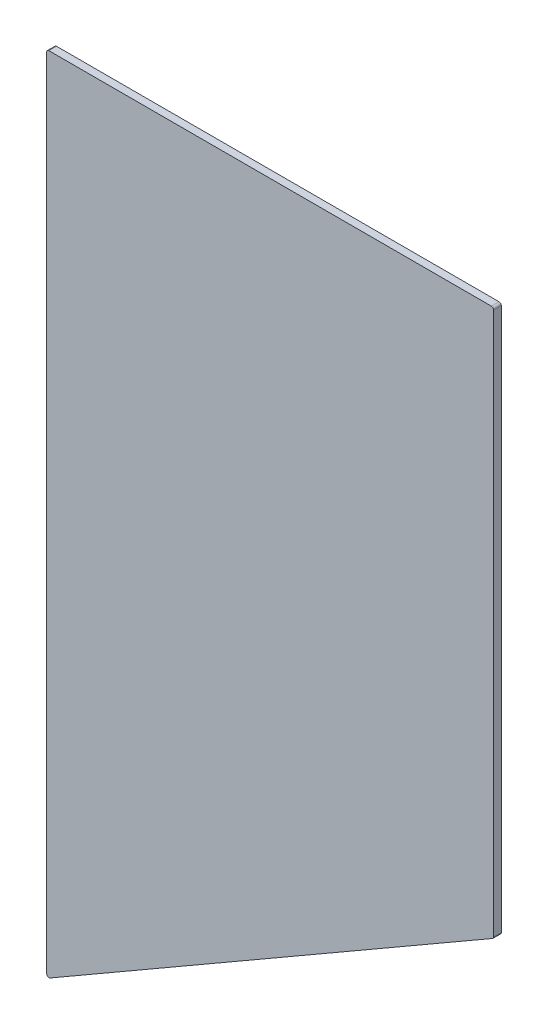
ISO-10303-21;
HEADER;
FILE_DESCRIPTION(('STEP AP214'),'2;1');
FILE_NAME('part.step','',(''),(''),'','','');
FILE_SCHEMA(('AUTOMOTIVE_DESIGN { 1 0 10303 214 1 1 1 1 }'));
ENDSEC;
DATA;
#1=APPLICATION_CONTEXT('core data for automotive mechanical design processes');
#2=APPLICATION_PROTOCOL_DEFINITION('international standard','automotive_design',2000,#1);
#3=PRODUCT_CONTEXT('',#1,'mechanical');
#4=PRODUCT('Part','Part','',(#3));
#5=PRODUCT_RELATED_PRODUCT_CATEGORY('part','',(#4));
#6=PRODUCT_DEFINITION_FORMATION('','',#4);
#7=PRODUCT_DEFINITION_CONTEXT('part definition',#1,'design');
#8=PRODUCT_DEFINITION('design','',#6,#7);
#9=PRODUCT_DEFINITION_SHAPE('','',#8);
#10=(LENGTH_UNIT() NAMED_UNIT(*) SI_UNIT(.MILLI.,.METRE.));
#11=(NAMED_UNIT(*) PLANE_ANGLE_UNIT() SI_UNIT($,.RADIAN.));
#12=(NAMED_UNIT(*) SI_UNIT($,.STERADIAN.) SOLID_ANGLE_UNIT());
#13=UNCERTAINTY_MEASURE_WITH_UNIT(LENGTH_MEASURE(1.E-05),#10,'distance_accuracy_value','');
#14=(GEOMETRIC_REPRESENTATION_CONTEXT(3) GLOBAL_UNCERTAINTY_ASSIGNED_CONTEXT((#13)) GLOBAL_UNIT_ASSIGNED_CONTEXT((#10,
#11,#12)) REPRESENTATION_CONTEXT('',''));
#15=CARTESIAN_POINT('',(0.,0.,0.));
#16=DIRECTION('',(0.,0.,1.));
#17=DIRECTION('',(1.,0.,0.));
#18=AXIS2_PLACEMENT_3D('',#15,#16,#17);
#19=CARTESIAN_POINT('',(127.,-228.6,4.3434));
#20=DIRECTION('',(-1.,0.,0.));
#21=DIRECTION('',(0.,0.,1.));
#22=AXIS2_PLACEMENT_3D('',#19,#20,#21);
#23=PLANE('',#22);
#24=DIRECTION('',(0.,1.,0.));
#25=VECTOR('',#24,1.);
#26=CARTESIAN_POINT('',(127.,-228.6,4.3434));
#27=LINE('',#26,#25);
#28=CARTESIAN_POINT('',(127.,-81.2197967839626,4.3434));
#29=VERTEX_POINT('',#28);
#30=CARTESIAN_POINT('',(127.,227.33,4.3434));
#31=VERTEX_POINT('',#30);
#32=EDGE_CURVE('E123',#29,#31,#27,.T.);
#33=ORIENTED_EDGE('',*,*,#32,.F.);
#34=DIRECTION('',(0.,0.,1.));
#35=VECTOR('',#34,1.);
#36=CARTESIAN_POINT('',(127.,-81.2197967839626,4.3434));
#37=LINE('',#36,#35);
#38=CARTESIAN_POINT('',(127.,-81.2197967839626,0.));
#39=VERTEX_POINT('',#38);
#40=EDGE_CURVE('E11',#29,#39,#37,.F.);
#41=ORIENTED_EDGE('',*,*,#40,.T.);
#42=DIRECTION('',(0.,1.,0.));
#43=VECTOR('',#42,1.);
#44=CARTESIAN_POINT('',(127.,-228.6,0.));
#45=LINE('',#44,#43);
#46=CARTESIAN_POINT('',(127.,227.33,0.));
#47=VERTEX_POINT('',#46);
#48=EDGE_CURVE('E128',#39,#47,#45,.T.);
#49=ORIENTED_EDGE('',*,*,#48,.T.);
#50=DIRECTION('',(0.,0.,-1.));
#51=VECTOR('',#50,1.);
#52=CARTESIAN_POINT('',(127.,227.33,4.3434));
#53=LINE('',#52,#51);
#54=EDGE_CURVE('E41',#47,#31,#53,.F.);
#55=ORIENTED_EDGE('',*,*,#54,.T.);
#56=EDGE_LOOP('',(#33,#41,#49,#55));
#57=FACE_BOUND('',#56,.T.);
#58=ADVANCED_FACE('F33',(#57),#23,.F.);
#59=CARTESIAN_POINT('',(-127.,228.6,4.3434));
#60=DIRECTION('',(0.,-1.,0.));
#61=DIRECTION('',(0.,0.,-1.));
#62=AXIS2_PLACEMENT_3D('',#59,#60,#61);
#63=PLANE('',#62);
#64=DIRECTION('',(-1.,0.,0.));
#65=VECTOR('',#64,1.);
#66=CARTESIAN_POINT('',(-127.,228.6,0.));
#67=LINE('',#66,#65);
#68=CARTESIAN_POINT('',(125.73,228.6,0.));
#69=VERTEX_POINT('',#68);
#70=CARTESIAN_POINT('',(-125.73,228.6,0.));
#71=VERTEX_POINT('',#70);
#72=EDGE_CURVE('E124',#69,#71,#67,.T.);
#73=ORIENTED_EDGE('',*,*,#72,.T.);
#74=DIRECTION('',(0.,0.,-1.));
#75=VECTOR('',#74,1.);
#76=CARTESIAN_POINT('',(-125.73,228.6,4.3434));
#77=LINE('',#76,#75);
#78=CARTESIAN_POINT('',(-125.73,228.6,4.3434));
#79=VERTEX_POINT('',#78);
#80=EDGE_CURVE('E102',#71,#79,#77,.F.);
#81=ORIENTED_EDGE('',*,*,#80,.T.);
#82=DIRECTION('',(-1.,0.,0.));
#83=VECTOR('',#82,1.);
#84=CARTESIAN_POINT('',(-127.,228.6,4.3434));
#85=LINE('',#84,#83);
#86=CARTESIAN_POINT('',(125.73,228.6,4.3434));
#87=VERTEX_POINT('',#86);
#88=EDGE_CURVE('E126',#87,#79,#85,.T.);
#89=ORIENTED_EDGE('',*,*,#88,.F.);
#90=DIRECTION('',(0.,0.,-1.));
#91=VECTOR('',#90,1.);
#92=CARTESIAN_POINT('',(125.73,228.6,4.3434));
#93=LINE('',#92,#91);
#94=EDGE_CURVE('E107',#87,#69,#93,.T.);
#95=ORIENTED_EDGE('',*,*,#94,.T.);
#96=EDGE_LOOP('',(#73,#81,#89,#95));
#97=FACE_BOUND('',#96,.T.);
#98=ADVANCED_FACE('F181',(#97),#63,.F.);
#99=CARTESIAN_POINT('',(-127.,-228.6,4.3434));
#100=DIRECTION('',(1.,0.,0.));
#101=DIRECTION('',(0.,0.,-1.));
#102=AXIS2_PLACEMENT_3D('',#99,#100,#101);
#103=PLANE('',#102);
#104=DIRECTION('',(0.,-1.,0.));
#105=VECTOR('',#104,1.);
#106=CARTESIAN_POINT('',(-127.,-228.6,4.3434));
#107=LINE('',#106,#105);
#108=CARTESIAN_POINT('',(-127.,227.33,4.3434));
#109=VERTEX_POINT('',#108);
#110=CARTESIAN_POINT('',(-127.,-226.400295474388,4.3434));
#111=VERTEX_POINT('',#110);
#112=EDGE_CURVE('E117',#109,#111,#107,.T.);
#113=ORIENTED_EDGE('',*,*,#112,.F.);
#114=DIRECTION('',(0.,0.,-1.));
#115=VECTOR('',#114,1.);
#116=CARTESIAN_POINT('',(-127.,227.33,4.3434));
#117=LINE('',#116,#115);
#118=CARTESIAN_POINT('',(-127.,227.33,0.));
#119=VERTEX_POINT('',#118);
#120=EDGE_CURVE('E101',#109,#119,#117,.T.);
#121=ORIENTED_EDGE('',*,*,#120,.T.);
#122=DIRECTION('',(0.,-1.,0.));
#123=VECTOR('',#122,1.);
#124=CARTESIAN_POINT('',(-127.,-228.6,0.));
#125=LINE('',#124,#123);
#126=CARTESIAN_POINT('',(-127.,-226.400295474388,0.));
#127=VERTEX_POINT('',#126);
#128=EDGE_CURVE('E114',#119,#127,#125,.T.);
#129=ORIENTED_EDGE('',*,*,#128,.T.);
#130=DIRECTION('',(0.,0.,-1.));
#131=VECTOR('',#130,1.);
#132=CARTESIAN_POINT('',(-127.,-226.400295474388,4.3434));
#133=LINE('',#132,#131);
#134=EDGE_CURVE('E119',#127,#111,#133,.F.);
#135=ORIENTED_EDGE('',*,*,#134,.T.);
#136=EDGE_LOOP('',(#113,#121,#129,#135));
#137=FACE_BOUND('',#136,.T.);
#138=ADVANCED_FACE('F113',(#137),#103,.F.);
#139=CARTESIAN_POINT('',(0.,0.,4.3434));
#140=DIRECTION('',(0.,0.,-1.));
#141=DIRECTION('',(-1.,0.,0.));
#142=AXIS2_PLACEMENT_3D('',#139,#140,#141);
#143=PLANE('',#142);
#144=ORIENTED_EDGE('',*,*,#88,.T.);
#145=CARTESIAN_POINT('',(-125.73,227.33,4.3434));
#146=DIRECTION('',(0.,0.,-1.));
#147=DIRECTION('',(-1.,0.,0.));
#148=AXIS2_PLACEMENT_3D('',#145,#146,#147);
#149=CIRCLE('',#148,1.27);
#150=EDGE_CURVE('E145',#79,#109,#149,.F.);
#151=ORIENTED_EDGE('',*,*,#150,.T.);
#152=ORIENTED_EDGE('',*,*,#112,.T.);
#153=CARTESIAN_POINT('',(-125.73,-226.400295474388,4.3434));
#154=DIRECTION('',(0.,0.,-1.));
#155=DIRECTION('',(-1.,0.,0.));
#156=AXIS2_PLACEMENT_3D('',#153,#154,#155);
#157=CIRCLE('',#156,1.27);
#158=CARTESIAN_POINT('',(-125.095,-227.500147737194,4.3434));
#159=VERTEX_POINT('',#158);
#160=EDGE_CURVE('E143',#111,#159,#157,.F.);
#161=ORIENTED_EDGE('',*,*,#160,.T.);
#162=DIRECTION('',(-0.866025403784436,-0.500000000000004,0.));
#163=VECTOR('',#162,1.);
#164=CARTESIAN_POINT('',(-127.,-228.6,4.3434));
#165=LINE('',#164,#163);
#166=CARTESIAN_POINT('',(126.365,-82.3196490467688,4.3434));
#167=VERTEX_POINT('',#166);
#168=EDGE_CURVE('E159',#167,#159,#165,.T.);
#169=ORIENTED_EDGE('',*,*,#168,.F.);
#170=CARTESIAN_POINT('',(125.73,-81.2197967839626,4.3434));
#171=DIRECTION('',(0.,0.,-1.));
#172=DIRECTION('',(-1.,0.,0.));
#173=AXIS2_PLACEMENT_3D('',#170,#171,#172);
#174=CIRCLE('',#173,1.27);
#175=EDGE_CURVE('E54',#167,#29,#174,.F.);
#176=ORIENTED_EDGE('',*,*,#175,.T.);
#177=ORIENTED_EDGE('',*,*,#32,.T.);
#178=CARTESIAN_POINT('',(125.73,227.33,4.3434));
#179=DIRECTION('',(0.,0.,-1.));
#180=DIRECTION('',(-1.,0.,0.));
#181=AXIS2_PLACEMENT_3D('',#178,#179,#180);
#182=CIRCLE('',#181,1.27);
#183=EDGE_CURVE('E140',#31,#87,#182,.F.);
#184=ORIENTED_EDGE('',*,*,#183,.T.);
#185=EDGE_LOOP('',(#144,#151,#152,#161,#169,#176,#177,#184));
#186=FACE_BOUND('',#185,.T.);
#187=ADVANCED_FACE('F169',(#186),#143,.F.);
#188=CARTESIAN_POINT('',(0.,0.,0.));
#189=DIRECTION('',(0.,0.,-1.));
#190=DIRECTION('',(-1.,0.,0.));
#191=AXIS2_PLACEMENT_3D('',#188,#189,#190);
#192=PLANE('',#191);
#193=ORIENTED_EDGE('',*,*,#128,.F.);
#194=CARTESIAN_POINT('',(-125.73,227.33,0.));
#195=DIRECTION('',(0.,0.,-1.));
#196=DIRECTION('',(-1.,0.,0.));
#197=AXIS2_PLACEMENT_3D('',#194,#195,#196);
#198=CIRCLE('',#197,1.27);
#199=EDGE_CURVE('E97',#119,#71,#198,.T.);
#200=ORIENTED_EDGE('',*,*,#199,.T.);
#201=ORIENTED_EDGE('',*,*,#72,.F.);
#202=CARTESIAN_POINT('',(125.73,227.33,0.));
#203=DIRECTION('',(0.,0.,-1.));
#204=DIRECTION('',(-1.,0.,0.));
#205=AXIS2_PLACEMENT_3D('',#202,#203,#204);
#206=CIRCLE('',#205,1.27);
#207=EDGE_CURVE('E118',#69,#47,#206,.T.);
#208=ORIENTED_EDGE('',*,*,#207,.T.);
#209=ORIENTED_EDGE('',*,*,#48,.F.);
#210=CARTESIAN_POINT('',(125.73,-81.2197967839626,0.));
#211=DIRECTION('',(0.,0.,-1.));
#212=DIRECTION('',(-1.,0.,0.));
#213=AXIS2_PLACEMENT_3D('',#210,#211,#212);
#214=CIRCLE('',#213,1.27);
#215=CARTESIAN_POINT('',(126.365,-82.3196490467688,0.));
#216=VERTEX_POINT('',#215);
#217=EDGE_CURVE('E134',#39,#216,#214,.T.);
#218=ORIENTED_EDGE('',*,*,#217,.T.);
#219=DIRECTION('',(-0.866025403784436,-0.500000000000004,0.));
#220=VECTOR('',#219,1.);
#221=CARTESIAN_POINT('',(-127.,-228.6,0.));
#222=LINE('',#221,#220);
#223=CARTESIAN_POINT('',(-125.095,-227.500147737194,0.));
#224=VERTEX_POINT('',#223);
#225=EDGE_CURVE('E157',#216,#224,#222,.T.);
#226=ORIENTED_EDGE('',*,*,#225,.T.);
#227=CARTESIAN_POINT('',(-125.73,-226.400295474388,0.));
#228=DIRECTION('',(0.,0.,-1.));
#229=DIRECTION('',(-1.,0.,0.));
#230=AXIS2_PLACEMENT_3D('',#227,#228,#229);
#231=CIRCLE('',#230,1.27);
#232=EDGE_CURVE('E108',#224,#127,#231,.T.);
#233=ORIENTED_EDGE('',*,*,#232,.T.);
#234=EDGE_LOOP('',(#193,#200,#201,#208,#209,#218,#226,#233));
#235=FACE_BOUND('',#234,.T.);
#236=ADVANCED_FACE('F121',(#235),#192,.T.);
#237=CARTESIAN_POINT('',(-127.,-228.6,0.));
#238=DIRECTION('',(-0.500000000000004,0.866025403784436,0.));
#239=DIRECTION('',(-0.866025403784436,-0.500000000000004,0.));
#240=AXIS2_PLACEMENT_3D('',#237,#238,#239);
#241=PLANE('',#240);
#242=ORIENTED_EDGE('',*,*,#168,.T.);
#243=DIRECTION('',(0.,0.,-1.));
#244=VECTOR('',#243,1.);
#245=CARTESIAN_POINT('',(-125.095,-227.500147737194,0.));
#246=LINE('',#245,#244);
#247=EDGE_CURVE('E150',#159,#224,#246,.T.);
#248=ORIENTED_EDGE('',*,*,#247,.T.);
#249=ORIENTED_EDGE('',*,*,#225,.F.);
#250=DIRECTION('',(0.,0.,1.));
#251=VECTOR('',#250,1.);
#252=CARTESIAN_POINT('',(126.365,-82.3196490467687,0.));
#253=LINE('',#252,#251);
#254=EDGE_CURVE('E147',#216,#167,#253,.T.);
#255=ORIENTED_EDGE('',*,*,#254,.T.);
#256=EDGE_LOOP('',(#242,#248,#249,#255));
#257=FACE_BOUND('',#256,.T.);
#258=ADVANCED_FACE('F156',(#257),#241,.F.);
#259=CARTESIAN_POINT('',(-125.73,227.33,4.3434));
#260=DIRECTION('',(0.,0.,-1.));
#261=DIRECTION('',(-1.,0.,0.));
#262=AXIS2_PLACEMENT_3D('',#259,#260,#261);
#263=CYLINDRICAL_SURFACE('',#262,1.27);
#264=ORIENTED_EDGE('',*,*,#150,.F.);
#265=ORIENTED_EDGE('',*,*,#80,.F.);
#266=ORIENTED_EDGE('',*,*,#199,.F.);
#267=ORIENTED_EDGE('',*,*,#120,.F.);
#268=EDGE_LOOP('',(#264,#265,#266,#267));
#269=FACE_BOUND('',#268,.T.);
#270=ADVANCED_FACE('F100',(#269),#263,.T.);
#271=CARTESIAN_POINT('',(-125.73,-226.400295474388,0.));
#272=DIRECTION('',(0.,0.,-1.));
#273=DIRECTION('',(-1.,0.,0.));
#274=AXIS2_PLACEMENT_3D('',#271,#272,#273);
#275=CYLINDRICAL_SURFACE('',#274,1.27);
#276=ORIENTED_EDGE('',*,*,#160,.F.);
#277=ORIENTED_EDGE('',*,*,#134,.F.);
#278=ORIENTED_EDGE('',*,*,#232,.F.);
#279=ORIENTED_EDGE('',*,*,#247,.F.);
#280=EDGE_LOOP('',(#276,#277,#278,#279));
#281=FACE_BOUND('',#280,.T.);
#282=ADVANCED_FACE('F170',(#281),#275,.T.);
#283=CARTESIAN_POINT('',(125.73,-81.2197967839626,0.));
#284=DIRECTION('',(0.,0.,1.));
#285=DIRECTION('',(1.,0.,0.));
#286=AXIS2_PLACEMENT_3D('',#283,#284,#285);
#287=CYLINDRICAL_SURFACE('',#286,1.27);
#288=ORIENTED_EDGE('',*,*,#217,.F.);
#289=ORIENTED_EDGE('',*,*,#40,.F.);
#290=ORIENTED_EDGE('',*,*,#175,.F.);
#291=ORIENTED_EDGE('',*,*,#254,.F.);
#292=EDGE_LOOP('',(#288,#289,#290,#291));
#293=FACE_BOUND('',#292,.T.);
#294=ADVANCED_FACE('F172',(#293),#287,.T.);
#295=CARTESIAN_POINT('',(125.73,227.33,4.3434));
#296=DIRECTION('',(0.,0.,-1.));
#297=DIRECTION('',(-1.,0.,0.));
#298=AXIS2_PLACEMENT_3D('',#295,#296,#297);
#299=CYLINDRICAL_SURFACE('',#298,1.27);
#300=ORIENTED_EDGE('',*,*,#183,.F.);
#301=ORIENTED_EDGE('',*,*,#54,.F.);
#302=ORIENTED_EDGE('',*,*,#207,.F.);
#303=ORIENTED_EDGE('',*,*,#94,.F.);
#304=EDGE_LOOP('',(#300,#301,#302,#303));
#305=FACE_BOUND('',#304,.T.);
#306=ADVANCED_FACE('F35',(#305),#299,.T.);
#307=CLOSED_SHELL('',(#58,#98,#138,#187,#236,#258,#270,#282,#294,#306));
#308=MANIFOLD_SOLID_BREP('B2',#307);
#309=ADVANCED_BREP_SHAPE_REPRESENTATION('',(#18,#308),#14);
#310=SHAPE_DEFINITION_REPRESENTATION(#9,#309);
ENDSEC;
END-ISO-10303-21;
